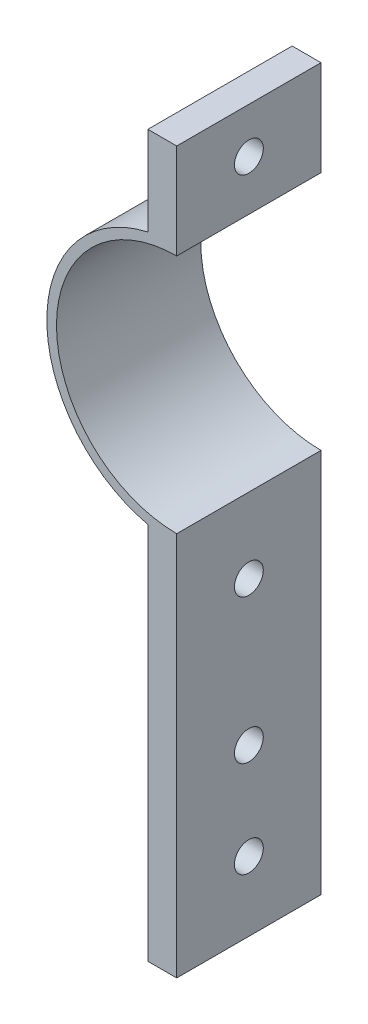
ISO-10303-21;
HEADER;
FILE_DESCRIPTION(('STEP AP214'),'2;1');
FILE_NAME('part.step','',(''),(''),'','','');
FILE_SCHEMA(('AUTOMOTIVE_DESIGN { 1 0 10303 214 1 1 1 1 }'));
ENDSEC;
DATA;
#1=APPLICATION_CONTEXT('core data for automotive mechanical design processes');
#2=APPLICATION_PROTOCOL_DEFINITION('international standard','automotive_design',2000,#1);
#3=PRODUCT_CONTEXT('',#1,'mechanical');
#4=PRODUCT('Part','Part','',(#3));
#5=PRODUCT_RELATED_PRODUCT_CATEGORY('part','',(#4));
#6=PRODUCT_DEFINITION_FORMATION('','',#4);
#7=PRODUCT_DEFINITION_CONTEXT('part definition',#1,'design');
#8=PRODUCT_DEFINITION('design','',#6,#7);
#9=PRODUCT_DEFINITION_SHAPE('','',#8);
#10=(LENGTH_UNIT() NAMED_UNIT(*) SI_UNIT(.MILLI.,.METRE.));
#11=(NAMED_UNIT(*) PLANE_ANGLE_UNIT() SI_UNIT($,.RADIAN.));
#12=(NAMED_UNIT(*) SI_UNIT($,.STERADIAN.) SOLID_ANGLE_UNIT());
#13=UNCERTAINTY_MEASURE_WITH_UNIT(LENGTH_MEASURE(1.E-05),#10,'distance_accuracy_value','');
#14=(GEOMETRIC_REPRESENTATION_CONTEXT(3) GLOBAL_UNCERTAINTY_ASSIGNED_CONTEXT((#13)) GLOBAL_UNIT_ASSIGNED_CONTEXT((#10,
#11,#12)) REPRESENTATION_CONTEXT('',''));
#15=CARTESIAN_POINT('',(0.,0.,0.));
#16=DIRECTION('',(0.,0.,1.));
#17=DIRECTION('',(1.,0.,0.));
#18=AXIS2_PLACEMENT_3D('',#15,#16,#17);
#19=CARTESIAN_POINT('',(0.,0.,15.));
#20=DIRECTION('',(0.,0.,-1.));
#21=DIRECTION('',(-1.,0.,0.));
#22=AXIS2_PLACEMENT_3D('',#19,#20,#21);
#23=CYLINDRICAL_SURFACE('',#22,13.5);
#24=CARTESIAN_POINT('',(0.,0.,0.));
#25=DIRECTION('',(0.,0.,1.));
#26=DIRECTION('',(1.,0.,0.));
#27=AXIS2_PLACEMENT_3D('',#24,#25,#26);
#28=CIRCLE('',#27,13.5);
#29=CARTESIAN_POINT('',(-3.,-13.1624465810882,0.));
#30=VERTEX_POINT('',#29);
#31=CARTESIAN_POINT('',(-3.,13.1624465810882,0.));
#32=VERTEX_POINT('',#31);
#33=EDGE_CURVE('E135',#30,#32,#28,.F.);
#34=ORIENTED_EDGE('',*,*,#33,.F.);
#35=DIRECTION('',(0.,0.,-1.));
#36=VECTOR('',#35,1.);
#37=CARTESIAN_POINT('',(-3.,-13.1624465810882,15.));
#38=LINE('',#37,#36);
#39=CARTESIAN_POINT('',(-3.,-13.1624465810882,15.));
#40=VERTEX_POINT('',#39);
#41=EDGE_CURVE('E11',#40,#30,#38,.T.);
#42=ORIENTED_EDGE('',*,*,#41,.F.);
#43=CARTESIAN_POINT('',(0.,0.,15.));
#44=DIRECTION('',(0.,0.,1.));
#45=DIRECTION('',(1.,0.,0.));
#46=AXIS2_PLACEMENT_3D('',#43,#44,#45);
#47=CIRCLE('',#46,13.5);
#48=CARTESIAN_POINT('',(-3.,13.1624465810882,15.));
#49=VERTEX_POINT('',#48);
#50=EDGE_CURVE('E156',#40,#49,#47,.F.);
#51=ORIENTED_EDGE('',*,*,#50,.T.);
#52=DIRECTION('',(0.,0.,-1.));
#53=VECTOR('',#52,1.);
#54=CARTESIAN_POINT('',(-3.,13.1624465810882,15.));
#55=LINE('',#54,#53);
#56=EDGE_CURVE('E57',#49,#32,#55,.T.);
#57=ORIENTED_EDGE('',*,*,#56,.T.);
#58=EDGE_LOOP('',(#34,#42,#51,#57));
#59=FACE_BOUND('',#58,.T.);
#60=ADVANCED_FACE('F39',(#59),#23,.T.);
#61=CARTESIAN_POINT('',(-3.,0.,15.));
#62=DIRECTION('',(1.,0.,0.));
#63=DIRECTION('',(0.,0.,-1.));
#64=AXIS2_PLACEMENT_3D('',#61,#62,#63);
#65=PLANE('',#64);
#66=CARTESIAN_POINT('',(-3.,-35.2915026221292,7.5));
#67=DIRECTION('',(-1.,0.,0.));
#68=DIRECTION('',(0.,0.,1.));
#69=AXIS2_PLACEMENT_3D('',#66,#67,#68);
#70=CIRCLE('',#69,1.5);
#71=CARTESIAN_POINT('',(-3.,-35.2915026221292,9.));
#72=VERTEX_POINT('',#71);
#73=EDGE_CURVE('E179',#72,#72,#70,.T.);
#74=ORIENTED_EDGE('',*,*,#73,.F.);
#75=EDGE_LOOP('',(#74));
#76=FACE_BOUND('',#75,.T.);
#77=CARTESIAN_POINT('',(-3.,-45.2915026221292,7.5));
#78=DIRECTION('',(-1.,0.,0.));
#79=DIRECTION('',(0.,0.,-1.));
#80=AXIS2_PLACEMENT_3D('',#77,#78,#79);
#81=CIRCLE('',#80,1.5);
#82=CARTESIAN_POINT('',(-3.,-45.2915026221292,6.));
#83=VERTEX_POINT('',#82);
#84=EDGE_CURVE('E183',#83,#83,#81,.T.);
#85=ORIENTED_EDGE('',*,*,#84,.F.);
#86=EDGE_LOOP('',(#85));
#87=FACE_BOUND('',#86,.T.);
#88=CARTESIAN_POINT('',(-3.,-20.2915026221292,7.5));
#89=DIRECTION('',(-1.,0.,0.));
#90=DIRECTION('',(0.,0.,1.));
#91=AXIS2_PLACEMENT_3D('',#88,#89,#90);
#92=CIRCLE('',#91,1.5);
#93=CARTESIAN_POINT('',(-3.,-20.2915026221292,9.));
#94=VERTEX_POINT('',#93);
#95=EDGE_CURVE('E166',#94,#94,#92,.T.);
#96=ORIENTED_EDGE('',*,*,#95,.F.);
#97=EDGE_LOOP('',(#96));
#98=FACE_BOUND('',#97,.T.);
#99=DIRECTION('',(0.,-1.,0.));
#100=VECTOR('',#99,1.);
#101=CARTESIAN_POINT('',(-3.,0.,0.));
#102=LINE('',#101,#100);
#103=CARTESIAN_POINT('',(-3.,-52.5,0.));
#104=VERTEX_POINT('',#103);
#105=EDGE_CURVE('E137',#30,#104,#102,.T.);
#106=ORIENTED_EDGE('',*,*,#105,.T.);
#107=DIRECTION('',(0.,0.,-1.));
#108=VECTOR('',#107,1.);
#109=CARTESIAN_POINT('',(-3.,-52.5,15.));
#110=LINE('',#109,#108);
#111=CARTESIAN_POINT('',(-3.,-52.5,15.));
#112=VERTEX_POINT('',#111);
#113=EDGE_CURVE('E48',#112,#104,#110,.T.);
#114=ORIENTED_EDGE('',*,*,#113,.F.);
#115=DIRECTION('',(0.,-1.,0.));
#116=VECTOR('',#115,1.);
#117=CARTESIAN_POINT('',(-3.,0.,15.));
#118=LINE('',#117,#116);
#119=EDGE_CURVE('E188',#40,#112,#118,.T.);
#120=ORIENTED_EDGE('',*,*,#119,.F.);
#121=ORIENTED_EDGE('',*,*,#41,.T.);
#122=EDGE_LOOP('',(#106,#114,#120,#121));
#123=FACE_BOUND('',#122,.T.);
#124=ADVANCED_FACE('F215',(#76,#87,#98,#123),#65,.F.);
#125=CARTESIAN_POINT('',(0.,-52.5,15.));
#126=DIRECTION('',(0.,-1.,0.));
#127=DIRECTION('',(0.,0.,-1.));
#128=AXIS2_PLACEMENT_3D('',#125,#126,#127);
#129=PLANE('',#128);
#130=DIRECTION('',(-1.,0.,0.));
#131=VECTOR('',#130,1.);
#132=CARTESIAN_POINT('',(0.,-52.5,0.));
#133=LINE('',#132,#131);
#134=CARTESIAN_POINT('',(0.,-52.5,0.));
#135=VERTEX_POINT('',#134);
#136=EDGE_CURVE('E141',#135,#104,#133,.T.);
#137=ORIENTED_EDGE('',*,*,#136,.F.);
#138=DIRECTION('',(0.,0.,-1.));
#139=VECTOR('',#138,1.);
#140=CARTESIAN_POINT('',(0.,-52.5,15.));
#141=LINE('',#140,#139);
#142=CARTESIAN_POINT('',(0.,-52.5,15.));
#143=VERTEX_POINT('',#142);
#144=EDGE_CURVE('E162',#143,#135,#141,.T.);
#145=ORIENTED_EDGE('',*,*,#144,.F.);
#146=DIRECTION('',(-1.,0.,0.));
#147=VECTOR('',#146,1.);
#148=CARTESIAN_POINT('',(0.,-52.5,15.));
#149=LINE('',#148,#147);
#150=EDGE_CURVE('E190',#143,#112,#149,.T.);
#151=ORIENTED_EDGE('',*,*,#150,.T.);
#152=ORIENTED_EDGE('',*,*,#113,.T.);
#153=EDGE_LOOP('',(#137,#145,#151,#152));
#154=FACE_BOUND('',#153,.T.);
#155=ADVANCED_FACE('F219',(#154),#129,.T.);
#156=CARTESIAN_POINT('',(0.,0.,15.));
#157=DIRECTION('',(1.,0.,0.));
#158=DIRECTION('',(0.,0.,-1.));
#159=AXIS2_PLACEMENT_3D('',#156,#157,#158);
#160=PLANE('',#159);
#161=CARTESIAN_POINT('',(0.,-35.2915026221292,7.5));
#162=DIRECTION('',(1.,0.,0.));
#163=DIRECTION('',(0.,0.,-1.));
#164=AXIS2_PLACEMENT_3D('',#161,#162,#163);
#165=CIRCLE('',#164,1.5);
#166=CARTESIAN_POINT('',(0.,-35.2915026221292,6.));
#167=VERTEX_POINT('',#166);
#168=EDGE_CURVE('E42',#167,#167,#165,.T.);
#169=ORIENTED_EDGE('',*,*,#168,.F.);
#170=EDGE_LOOP('',(#169));
#171=FACE_BOUND('',#170,.T.);
#172=CARTESIAN_POINT('',(0.,-45.2915026221292,7.5));
#173=DIRECTION('',(1.,0.,0.));
#174=DIRECTION('',(0.,0.,-1.));
#175=AXIS2_PLACEMENT_3D('',#172,#173,#174);
#176=CIRCLE('',#175,1.5);
#177=CARTESIAN_POINT('',(0.,-45.2915026221292,6.));
#178=VERTEX_POINT('',#177);
#179=EDGE_CURVE('E167',#178,#178,#176,.T.);
#180=ORIENTED_EDGE('',*,*,#179,.F.);
#181=EDGE_LOOP('',(#180));
#182=FACE_BOUND('',#181,.T.);
#183=CARTESIAN_POINT('',(0.,-20.2915026221292,7.5));
#184=DIRECTION('',(1.,0.,0.));
#185=DIRECTION('',(0.,0.,-1.));
#186=AXIS2_PLACEMENT_3D('',#183,#184,#185);
#187=CIRCLE('',#186,1.5);
#188=CARTESIAN_POINT('',(0.,-20.2915026221292,6.));
#189=VERTEX_POINT('',#188);
#190=EDGE_CURVE('E138',#189,#189,#187,.T.);
#191=ORIENTED_EDGE('',*,*,#190,.F.);
#192=EDGE_LOOP('',(#191));
#193=FACE_BOUND('',#192,.T.);
#194=DIRECTION('',(0.,-1.,0.));
#195=VECTOR('',#194,1.);
#196=CARTESIAN_POINT('',(0.,0.,0.));
#197=LINE('',#196,#195);
#198=CARTESIAN_POINT('',(0.,-12.5,0.));
#199=VERTEX_POINT('',#198);
#200=EDGE_CURVE('E144',#199,#135,#197,.T.);
#201=ORIENTED_EDGE('',*,*,#200,.F.);
#202=DIRECTION('',(0.,0.,-1.));
#203=VECTOR('',#202,1.);
#204=CARTESIAN_POINT('',(0.,-12.5,15.));
#205=LINE('',#204,#203);
#206=CARTESIAN_POINT('',(0.,-12.5,15.));
#207=VERTEX_POINT('',#206);
#208=EDGE_CURVE('E160',#207,#199,#205,.T.);
#209=ORIENTED_EDGE('',*,*,#208,.F.);
#210=DIRECTION('',(0.,-1.,0.));
#211=VECTOR('',#210,1.);
#212=CARTESIAN_POINT('',(0.,0.,15.));
#213=LINE('',#212,#211);
#214=EDGE_CURVE('E193',#207,#143,#213,.T.);
#215=ORIENTED_EDGE('',*,*,#214,.T.);
#216=ORIENTED_EDGE('',*,*,#144,.T.);
#217=EDGE_LOOP('',(#201,#209,#215,#216));
#218=FACE_BOUND('',#217,.T.);
#219=ADVANCED_FACE('F224',(#171,#182,#193,#218),#160,.T.);
#220=CARTESIAN_POINT('',(0.,0.,15.));
#221=DIRECTION('',(0.,0.,-1.));
#222=DIRECTION('',(-1.,0.,0.));
#223=AXIS2_PLACEMENT_3D('',#220,#221,#222);
#224=CYLINDRICAL_SURFACE('',#223,12.5);
#225=CARTESIAN_POINT('',(0.,0.,0.));
#226=DIRECTION('',(0.,0.,1.));
#227=DIRECTION('',(1.,0.,0.));
#228=AXIS2_PLACEMENT_3D('',#225,#226,#227);
#229=CIRCLE('',#228,12.5);
#230=CARTESIAN_POINT('',(0.,12.5,0.));
#231=VERTEX_POINT('',#230);
#232=EDGE_CURVE('E147',#231,#199,#229,.T.);
#233=ORIENTED_EDGE('',*,*,#232,.F.);
#234=DIRECTION('',(0.,0.,-1.));
#235=VECTOR('',#234,1.);
#236=CARTESIAN_POINT('',(0.,12.5,15.));
#237=LINE('',#236,#235);
#238=CARTESIAN_POINT('',(0.,12.5,15.));
#239=VERTEX_POINT('',#238);
#240=EDGE_CURVE('E127',#239,#231,#237,.T.);
#241=ORIENTED_EDGE('',*,*,#240,.F.);
#242=CARTESIAN_POINT('',(0.,0.,15.));
#243=DIRECTION('',(0.,0.,1.));
#244=DIRECTION('',(1.,0.,0.));
#245=AXIS2_PLACEMENT_3D('',#242,#243,#244);
#246=CIRCLE('',#245,12.5);
#247=EDGE_CURVE('E117',#239,#207,#246,.T.);
#248=ORIENTED_EDGE('',*,*,#247,.T.);
#249=ORIENTED_EDGE('',*,*,#208,.T.);
#250=EDGE_LOOP('',(#233,#241,#248,#249));
#251=FACE_BOUND('',#250,.T.);
#252=ADVANCED_FACE('F197',(#251),#224,.F.);
#253=CARTESIAN_POINT('',(0.,0.,15.));
#254=DIRECTION('',(-1.,0.,0.));
#255=DIRECTION('',(0.,0.,1.));
#256=AXIS2_PLACEMENT_3D('',#253,#254,#255);
#257=PLANE('',#256);
#258=CARTESIAN_POINT('',(0.,17.6967310867334,7.5));
#259=DIRECTION('',(-1.,0.,0.));
#260=DIRECTION('',(0.,0.,1.));
#261=AXIS2_PLACEMENT_3D('',#258,#259,#260);
#262=CIRCLE('',#261,1.5);
#263=CARTESIAN_POINT('',(0.,17.6967310867334,9.));
#264=VERTEX_POINT('',#263);
#265=EDGE_CURVE('E169',#264,#264,#262,.T.);
#266=ORIENTED_EDGE('',*,*,#265,.T.);
#267=EDGE_LOOP('',(#266));
#268=FACE_BOUND('',#267,.T.);
#269=DIRECTION('',(0.,1.,0.));
#270=VECTOR('',#269,1.);
#271=CARTESIAN_POINT('',(0.,0.,0.));
#272=LINE('',#271,#270);
#273=CARTESIAN_POINT('',(0.,22.4052284646042,0.));
#274=VERTEX_POINT('',#273);
#275=EDGE_CURVE('E124',#231,#274,#272,.T.);
#276=ORIENTED_EDGE('',*,*,#275,.T.);
#277=DIRECTION('',(0.,0.,-1.));
#278=VECTOR('',#277,1.);
#279=CARTESIAN_POINT('',(0.,22.4052284646042,15.));
#280=LINE('',#279,#278);
#281=CARTESIAN_POINT('',(0.,22.4052284646042,15.));
#282=VERTEX_POINT('',#281);
#283=EDGE_CURVE('E121',#282,#274,#280,.T.);
#284=ORIENTED_EDGE('',*,*,#283,.F.);
#285=DIRECTION('',(0.,1.,0.));
#286=VECTOR('',#285,1.);
#287=CARTESIAN_POINT('',(0.,0.,15.));
#288=LINE('',#287,#286);
#289=EDGE_CURVE('E108',#239,#282,#288,.T.);
#290=ORIENTED_EDGE('',*,*,#289,.F.);
#291=ORIENTED_EDGE('',*,*,#240,.T.);
#292=EDGE_LOOP('',(#276,#284,#290,#291));
#293=FACE_BOUND('',#292,.T.);
#294=ADVANCED_FACE('F122',(#268,#293),#257,.F.);
#295=CARTESIAN_POINT('',(0.,22.4052284646042,15.));
#296=DIRECTION('',(0.,-1.,0.));
#297=DIRECTION('',(0.,0.,-1.));
#298=AXIS2_PLACEMENT_3D('',#295,#296,#297);
#299=PLANE('',#298);
#300=DIRECTION('',(-1.,0.,0.));
#301=VECTOR('',#300,1.);
#302=CARTESIAN_POINT('',(0.,22.4052284646042,0.));
#303=LINE('',#302,#301);
#304=CARTESIAN_POINT('',(-3.,22.4052284646042,0.));
#305=VERTEX_POINT('',#304);
#306=EDGE_CURVE('E151',#274,#305,#303,.T.);
#307=ORIENTED_EDGE('',*,*,#306,.T.);
#308=DIRECTION('',(0.,0.,-1.));
#309=VECTOR('',#308,1.);
#310=CARTESIAN_POINT('',(-3.,22.4052284646042,15.));
#311=LINE('',#310,#309);
#312=CARTESIAN_POINT('',(-3.,22.4052284646042,15.));
#313=VERTEX_POINT('',#312);
#314=EDGE_CURVE('E83',#313,#305,#311,.T.);
#315=ORIENTED_EDGE('',*,*,#314,.F.);
#316=DIRECTION('',(-1.,0.,0.));
#317=VECTOR('',#316,1.);
#318=CARTESIAN_POINT('',(0.,22.4052284646042,15.));
#319=LINE('',#318,#317);
#320=EDGE_CURVE('E114',#282,#313,#319,.T.);
#321=ORIENTED_EDGE('',*,*,#320,.F.);
#322=ORIENTED_EDGE('',*,*,#283,.T.);
#323=EDGE_LOOP('',(#307,#315,#321,#322));
#324=FACE_BOUND('',#323,.T.);
#325=ADVANCED_FACE('F129',(#324),#299,.F.);
#326=CARTESIAN_POINT('',(-3.,0.,15.));
#327=DIRECTION('',(-1.,0.,0.));
#328=DIRECTION('',(0.,0.,1.));
#329=AXIS2_PLACEMENT_3D('',#326,#327,#328);
#330=PLANE('',#329);
#331=CARTESIAN_POINT('',(-3.,17.6967310867334,7.5));
#332=DIRECTION('',(-1.,0.,0.));
#333=DIRECTION('',(0.,0.,1.));
#334=AXIS2_PLACEMENT_3D('',#331,#332,#333);
#335=CIRCLE('',#334,1.5);
#336=CARTESIAN_POINT('',(-3.,17.6967310867334,9.));
#337=VERTEX_POINT('',#336);
#338=EDGE_CURVE('E174',#337,#337,#335,.T.);
#339=ORIENTED_EDGE('',*,*,#338,.F.);
#340=EDGE_LOOP('',(#339));
#341=FACE_BOUND('',#340,.T.);
#342=DIRECTION('',(0.,1.,0.));
#343=VECTOR('',#342,1.);
#344=CARTESIAN_POINT('',(-3.,0.,0.));
#345=LINE('',#344,#343);
#346=EDGE_CURVE('E153',#32,#305,#345,.T.);
#347=ORIENTED_EDGE('',*,*,#346,.F.);
#348=ORIENTED_EDGE('',*,*,#56,.F.);
#349=DIRECTION('',(0.,1.,0.));
#350=VECTOR('',#349,1.);
#351=CARTESIAN_POINT('',(-3.,0.,15.));
#352=LINE('',#351,#350);
#353=EDGE_CURVE('E130',#49,#313,#352,.T.);
#354=ORIENTED_EDGE('',*,*,#353,.T.);
#355=ORIENTED_EDGE('',*,*,#314,.T.);
#356=EDGE_LOOP('',(#347,#348,#354,#355));
#357=FACE_BOUND('',#356,.T.);
#358=ADVANCED_FACE('F202',(#341,#357),#330,.T.);
#359=CARTESIAN_POINT('',(0.,0.,15.));
#360=DIRECTION('',(0.,0.,1.));
#361=DIRECTION('',(1.,0.,0.));
#362=AXIS2_PLACEMENT_3D('',#359,#360,#361);
#363=PLANE('',#362);
#364=ORIENTED_EDGE('',*,*,#50,.F.);
#365=ORIENTED_EDGE('',*,*,#119,.T.);
#366=ORIENTED_EDGE('',*,*,#150,.F.);
#367=ORIENTED_EDGE('',*,*,#214,.F.);
#368=ORIENTED_EDGE('',*,*,#247,.F.);
#369=ORIENTED_EDGE('',*,*,#289,.T.);
#370=ORIENTED_EDGE('',*,*,#320,.T.);
#371=ORIENTED_EDGE('',*,*,#353,.F.);
#372=EDGE_LOOP('',(#364,#365,#366,#367,#368,#369,#370,#371));
#373=FACE_BOUND('',#372,.T.);
#374=ADVANCED_FACE('F111',(#373),#363,.T.);
#375=CARTESIAN_POINT('',(0.,0.,0.));
#376=DIRECTION('',(0.,0.,1.));
#377=DIRECTION('',(1.,0.,0.));
#378=AXIS2_PLACEMENT_3D('',#375,#376,#377);
#379=PLANE('',#378);
#380=ORIENTED_EDGE('',*,*,#33,.T.);
#381=ORIENTED_EDGE('',*,*,#346,.T.);
#382=ORIENTED_EDGE('',*,*,#306,.F.);
#383=ORIENTED_EDGE('',*,*,#275,.F.);
#384=ORIENTED_EDGE('',*,*,#232,.T.);
#385=ORIENTED_EDGE('',*,*,#200,.T.);
#386=ORIENTED_EDGE('',*,*,#136,.T.);
#387=ORIENTED_EDGE('',*,*,#105,.F.);
#388=EDGE_LOOP('',(#380,#381,#382,#383,#384,#385,#386,#387));
#389=FACE_BOUND('',#388,.T.);
#390=ADVANCED_FACE('F200',(#389),#379,.F.);
#391=CARTESIAN_POINT('',(17.,-20.2915026221292,7.5));
#392=DIRECTION('',(-1.,0.,0.));
#393=DIRECTION('',(0.,0.,1.));
#394=AXIS2_PLACEMENT_3D('',#391,#392,#393);
#395=CYLINDRICAL_SURFACE('',#394,1.5);
#396=ORIENTED_EDGE('',*,*,#190,.T.);
#397=EDGE_LOOP('',(#396));
#398=FACE_BOUND('',#397,.T.);
#399=ORIENTED_EDGE('',*,*,#95,.T.);
#400=EDGE_LOOP('',(#399));
#401=FACE_BOUND('',#400,.T.);
#402=ADVANCED_FACE('F263',(#398,#401),#395,.F.);
#403=CARTESIAN_POINT('',(17.,17.6967310867334,7.5));
#404=DIRECTION('',(-1.,0.,0.));
#405=DIRECTION('',(0.,0.,1.));
#406=AXIS2_PLACEMENT_3D('',#403,#404,#405);
#407=CYLINDRICAL_SURFACE('',#406,1.5);
#408=ORIENTED_EDGE('',*,*,#338,.T.);
#409=EDGE_LOOP('',(#408));
#410=FACE_BOUND('',#409,.T.);
#411=ORIENTED_EDGE('',*,*,#265,.F.);
#412=EDGE_LOOP('',(#411));
#413=FACE_BOUND('',#412,.T.);
#414=ADVANCED_FACE('F297',(#410,#413),#407,.F.);
#415=CARTESIAN_POINT('',(17.,-45.2915026221292,7.5));
#416=DIRECTION('',(-1.,0.,0.));
#417=DIRECTION('',(0.,0.,1.));
#418=AXIS2_PLACEMENT_3D('',#415,#416,#417);
#419=CYLINDRICAL_SURFACE('',#418,1.5);
#420=ORIENTED_EDGE('',*,*,#179,.T.);
#421=EDGE_LOOP('',(#420));
#422=FACE_BOUND('',#421,.T.);
#423=ORIENTED_EDGE('',*,*,#84,.T.);
#424=EDGE_LOOP('',(#423));
#425=FACE_BOUND('',#424,.T.);
#426=ADVANCED_FACE('F304',(#422,#425),#419,.F.);
#427=CARTESIAN_POINT('',(17.,-35.2915026221292,7.5));
#428=DIRECTION('',(-1.,0.,0.));
#429=DIRECTION('',(0.,0.,1.));
#430=AXIS2_PLACEMENT_3D('',#427,#428,#429);
#431=CYLINDRICAL_SURFACE('',#430,1.5);
#432=ORIENTED_EDGE('',*,*,#168,.T.);
#433=EDGE_LOOP('',(#432));
#434=FACE_BOUND('',#433,.T.);
#435=ORIENTED_EDGE('',*,*,#73,.T.);
#436=EDGE_LOOP('',(#435));
#437=FACE_BOUND('',#436,.T.);
#438=ADVANCED_FACE('F312',(#434,#437),#431,.F.);
#439=CLOSED_SHELL('',(#60,#124,#155,#219,#252,#294,#325,#358,#374,#390,#402,#414,#426,#438));
#440=MANIFOLD_SOLID_BREP('B2',#439);
#441=ADVANCED_BREP_SHAPE_REPRESENTATION('',(#18,#440),#14);
#442=SHAPE_DEFINITION_REPRESENTATION(#9,#441);
ENDSEC;
END-ISO-10303-21;
